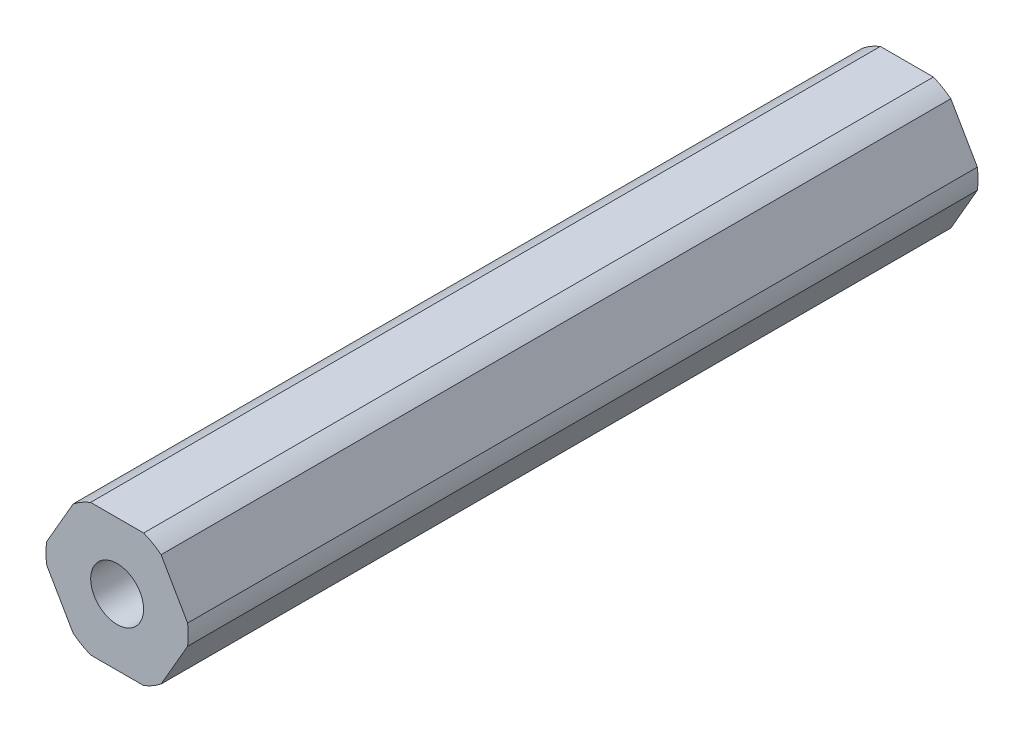
ISO-10303-21;
HEADER;
FILE_DESCRIPTION(('STEP AP214'),'2;1');
FILE_NAME('part.step','',(''),(''),'','','');
FILE_SCHEMA(('AUTOMOTIVE_DESIGN { 1 0 10303 214 1 1 1 1 }'));
ENDSEC;
DATA;
#1=APPLICATION_CONTEXT('core data for automotive mechanical design processes');
#2=APPLICATION_PROTOCOL_DEFINITION('international standard','automotive_design',2000,#1);
#3=PRODUCT_CONTEXT('',#1,'mechanical');
#4=PRODUCT('Part','Part','',(#3));
#5=PRODUCT_RELATED_PRODUCT_CATEGORY('part','',(#4));
#6=PRODUCT_DEFINITION_FORMATION('','',#4);
#7=PRODUCT_DEFINITION_CONTEXT('part definition',#1,'design');
#8=PRODUCT_DEFINITION('design','',#6,#7);
#9=PRODUCT_DEFINITION_SHAPE('','',#8);
#10=(LENGTH_UNIT() NAMED_UNIT(*) SI_UNIT(.MILLI.,.METRE.));
#11=(NAMED_UNIT(*) PLANE_ANGLE_UNIT() SI_UNIT($,.RADIAN.));
#12=(NAMED_UNIT(*) SI_UNIT($,.STERADIAN.) SOLID_ANGLE_UNIT());
#13=UNCERTAINTY_MEASURE_WITH_UNIT(LENGTH_MEASURE(1.E-05),#10,'distance_accuracy_value','');
#14=(GEOMETRIC_REPRESENTATION_CONTEXT(3) GLOBAL_UNCERTAINTY_ASSIGNED_CONTEXT((#13)) GLOBAL_UNIT_ASSIGNED_CONTEXT((#10,
#11,#12)) REPRESENTATION_CONTEXT('',''));
#15=CARTESIAN_POINT('',(0.,0.,0.));
#16=DIRECTION('',(0.,0.,1.));
#17=DIRECTION('',(1.,0.,0.));
#18=AXIS2_PLACEMENT_3D('',#15,#16,#17);
#19=CARTESIAN_POINT('',(0.,0.,-228.6));
#20=DIRECTION('',(0.,0.,-1.));
#21=DIRECTION('',(1.,0.,0.));
#22=AXIS2_PLACEMENT_3D('',#19,#20,#21);
#23=CYLINDRICAL_SURFACE('',#22,2.55);
#24=CARTESIAN_POINT('',(0.,0.,-228.6));
#25=DIRECTION('',(0.,0.,1.));
#26=DIRECTION('',(1.,0.,0.));
#27=AXIS2_PLACEMENT_3D('',#24,#25,#26);
#28=CIRCLE('',#27,2.55);
#29=CARTESIAN_POINT('',(-2.55,0.,-228.6));
#30=VERTEX_POINT('',#29);
#31=EDGE_CURVE('E64',#30,#30,#28,.T.);
#32=ORIENTED_EDGE('',*,*,#31,.F.);
#33=EDGE_LOOP('',(#32));
#34=FACE_BOUND('',#33,.T.);
#35=CARTESIAN_POINT('',(0.,0.,-152.4));
#36=DIRECTION('',(0.,0.,1.));
#37=DIRECTION('',(1.,0.,0.));
#38=AXIS2_PLACEMENT_3D('',#35,#36,#37);
#39=CIRCLE('',#38,2.55);
#40=CARTESIAN_POINT('',(2.55,0.,-152.4));
#41=VERTEX_POINT('',#40);
#42=EDGE_CURVE('E177',#41,#41,#39,.F.);
#43=ORIENTED_EDGE('',*,*,#42,.F.);
#44=EDGE_LOOP('',(#43));
#45=FACE_BOUND('',#44,.T.);
#46=ADVANCED_FACE('F39',(#34,#45),#23,.F.);
#47=CARTESIAN_POINT('',(0.,0.,-228.6));
#48=DIRECTION('',(0.,0.,-1.));
#49=DIRECTION('',(1.,0.,0.));
#50=AXIS2_PLACEMENT_3D('',#47,#48,#49);
#51=CYLINDRICAL_SURFACE('',#50,6.87);
#52=DIRECTION('',(0.,0.,1.));
#53=VECTOR('',#52,1.);
#54=CARTESIAN_POINT('',(6.80102150534208,0.971085209378949,-228.6));
#55=LINE('',#54,#53);
#56=CARTESIAN_POINT('',(6.80102150534208,0.97108520937895,-228.6));
#57=VERTEX_POINT('',#56);
#58=CARTESIAN_POINT('',(6.80102150534208,0.971085209378949,-152.4));
#59=VERTEX_POINT('',#58);
#60=EDGE_CURVE('E163',#57,#59,#55,.T.);
#61=ORIENTED_EDGE('',*,*,#60,.T.);
#62=CARTESIAN_POINT('',(0.,0.,-152.4));
#63=DIRECTION('',(0.,0.,1.));
#64=DIRECTION('',(1.,0.,0.));
#65=AXIS2_PLACEMENT_3D('',#62,#63,#64);
#66=CIRCLE('',#65,6.87);
#67=CARTESIAN_POINT('',(6.80102150534208,-0.971085209378956,-152.4));
#68=VERTEX_POINT('',#67);
#69=EDGE_CURVE('E257',#68,#59,#66,.T.);
#70=ORIENTED_EDGE('',*,*,#69,.F.);
#71=DIRECTION('',(0.,0.,-1.));
#72=VECTOR('',#71,1.);
#73=CARTESIAN_POINT('',(6.80102150534208,-0.971085209378962,-128.6));
#74=LINE('',#73,#72);
#75=CARTESIAN_POINT('',(6.80102150534208,-0.971085209378955,-228.6));
#76=VERTEX_POINT('',#75);
#77=EDGE_CURVE('E11',#68,#76,#74,.T.);
#78=ORIENTED_EDGE('',*,*,#77,.T.);
#79=CARTESIAN_POINT('',(0.,0.,-228.6));
#80=DIRECTION('',(0.,0.,1.));
#81=DIRECTION('',(1.,0.,0.));
#82=AXIS2_PLACEMENT_3D('',#79,#80,#81);
#83=CIRCLE('',#82,6.87);
#84=EDGE_CURVE('E49',#76,#57,#83,.T.);
#85=ORIENTED_EDGE('',*,*,#84,.T.);
#86=EDGE_LOOP('',(#61,#70,#78,#85));
#87=FACE_BOUND('',#86,.T.);
#88=ADVANCED_FACE('F269',(#87),#51,.T.);
#89=CARTESIAN_POINT('',(3.68083890619154,-6.3754,228.6));
#90=DIRECTION('',(-0.866025403784439,0.5,0.));
#91=DIRECTION('',(0.,0.,1.));
#92=AXIS2_PLACEMENT_3D('',#89,#90,#91);
#93=PLANE('',#92);
#94=DIRECTION('',(0.500000000000001,0.866025403784438,0.));
#95=VECTOR('',#94,1.);
#96=CARTESIAN_POINT('',(4.24149521323254,-5.40431479062105,-152.4));
#97=LINE('',#96,#95);
#98=CARTESIAN_POINT('',(4.24149521323254,-5.40431479062105,-152.4));
#99=VERTEX_POINT('',#98);
#100=EDGE_CURVE('E218',#99,#68,#97,.T.);
#101=ORIENTED_EDGE('',*,*,#100,.F.);
#102=DIRECTION('',(0.,0.,1.));
#103=VECTOR('',#102,1.);
#104=CARTESIAN_POINT('',(4.24149521323255,-5.40431479062104,-228.6));
#105=LINE('',#104,#103);
#106=CARTESIAN_POINT('',(4.24149521323254,-5.40431479062105,-228.6));
#107=VERTEX_POINT('',#106);
#108=EDGE_CURVE('E43',#107,#99,#105,.T.);
#109=ORIENTED_EDGE('',*,*,#108,.F.);
#110=DIRECTION('',(0.5,0.866025403784439,0.));
#111=VECTOR('',#110,1.);
#112=CARTESIAN_POINT('',(4.24149521323254,-5.40431479062105,-228.6));
#113=LINE('',#112,#111);
#114=EDGE_CURVE('E175',#107,#76,#113,.T.);
#115=ORIENTED_EDGE('',*,*,#114,.T.);
#116=ORIENTED_EDGE('',*,*,#77,.F.);
#117=EDGE_LOOP('',(#101,#109,#115,#116));
#118=FACE_BOUND('',#117,.T.);
#119=ADVANCED_FACE('F297',(#118),#93,.F.);
#120=CARTESIAN_POINT('',(7.36167781238308,0.,228.6));
#121=DIRECTION('',(-0.866025403784439,-0.5,0.));
#122=DIRECTION('',(0.,0.,1.));
#123=AXIS2_PLACEMENT_3D('',#120,#121,#122);
#124=PLANE('',#123);
#125=DIRECTION('',(-0.5,0.866025403784438,0.));
#126=VECTOR('',#125,1.);
#127=CARTESIAN_POINT('',(6.80102150534208,0.971085209378949,-152.4));
#128=LINE('',#127,#126);
#129=CARTESIAN_POINT('',(4.24149521323254,5.40431479062105,-152.4));
#130=VERTEX_POINT('',#129);
#131=EDGE_CURVE('E57',#59,#130,#128,.T.);
#132=ORIENTED_EDGE('',*,*,#131,.F.);
#133=ORIENTED_EDGE('',*,*,#60,.F.);
#134=DIRECTION('',(-0.5,0.866025403784439,0.));
#135=VECTOR('',#134,1.);
#136=CARTESIAN_POINT('',(6.80102150534208,0.971085209378949,-228.6));
#137=LINE('',#136,#135);
#138=CARTESIAN_POINT('',(4.24149521323254,5.40431479062105,-228.6));
#139=VERTEX_POINT('',#138);
#140=EDGE_CURVE('E185',#57,#139,#137,.T.);
#141=ORIENTED_EDGE('',*,*,#140,.T.);
#142=DIRECTION('',(0.,0.,-1.));
#143=VECTOR('',#142,1.);
#144=CARTESIAN_POINT('',(4.24149521323254,5.40431479062105,-128.6));
#145=LINE('',#144,#143);
#146=EDGE_CURVE('E85',#130,#139,#145,.T.);
#147=ORIENTED_EDGE('',*,*,#146,.F.);
#148=EDGE_LOOP('',(#132,#133,#141,#147));
#149=FACE_BOUND('',#148,.T.);
#150=ADVANCED_FACE('F268',(#149),#124,.F.);
#151=CARTESIAN_POINT('',(3.68083890619154,6.3754,228.6));
#152=DIRECTION('',(0.,-1.,0.));
#153=DIRECTION('',(0.,0.,-1.));
#154=AXIS2_PLACEMENT_3D('',#151,#152,#153);
#155=PLANE('',#154);
#156=DIRECTION('',(-1.,0.,0.));
#157=VECTOR('',#156,1.);
#158=CARTESIAN_POINT('',(2.55952629210953,6.3754,-152.4));
#159=LINE('',#158,#157);
#160=CARTESIAN_POINT('',(2.55952629210953,6.3754,-152.4));
#161=VERTEX_POINT('',#160);
#162=CARTESIAN_POINT('',(-2.55952629210953,6.3754,-152.4));
#163=VERTEX_POINT('',#162);
#164=EDGE_CURVE('E248',#161,#163,#159,.T.);
#165=ORIENTED_EDGE('',*,*,#164,.F.);
#166=DIRECTION('',(0.,0.,1.));
#167=VECTOR('',#166,1.);
#168=CARTESIAN_POINT('',(2.55952629210952,6.3754,-228.6));
#169=LINE('',#168,#167);
#170=CARTESIAN_POINT('',(2.55952629210952,6.3754,-228.6));
#171=VERTEX_POINT('',#170);
#172=EDGE_CURVE('E164',#171,#161,#169,.T.);
#173=ORIENTED_EDGE('',*,*,#172,.F.);
#174=DIRECTION('',(-1.,0.,0.));
#175=VECTOR('',#174,1.);
#176=CARTESIAN_POINT('',(2.55952629210952,6.3754,-228.6));
#177=LINE('',#176,#175);
#178=CARTESIAN_POINT('',(-2.55952629210953,6.3754,-228.6));
#179=VERTEX_POINT('',#178);
#180=EDGE_CURVE('E141',#171,#179,#177,.T.);
#181=ORIENTED_EDGE('',*,*,#180,.T.);
#182=DIRECTION('',(0.,0.,-1.));
#183=VECTOR('',#182,1.);
#184=CARTESIAN_POINT('',(-2.55952629210953,6.3754,-128.6));
#185=LINE('',#184,#183);
#186=EDGE_CURVE('E111',#163,#179,#185,.T.);
#187=ORIENTED_EDGE('',*,*,#186,.F.);
#188=EDGE_LOOP('',(#165,#173,#181,#187));
#189=FACE_BOUND('',#188,.T.);
#190=ADVANCED_FACE('F278',(#189),#155,.F.);
#191=CARTESIAN_POINT('',(-3.68083890619154,6.3754,228.6));
#192=DIRECTION('',(0.866025403784439,-0.5,0.));
#193=DIRECTION('',(0.,0.,-1.));
#194=AXIS2_PLACEMENT_3D('',#191,#192,#193);
#195=PLANE('',#194);
#196=DIRECTION('',(-0.500000000000001,-0.866025403784438,0.));
#197=VECTOR('',#196,1.);
#198=CARTESIAN_POINT('',(-4.24149521323254,5.40431479062105,-152.4));
#199=LINE('',#198,#197);
#200=CARTESIAN_POINT('',(-4.24149521323254,5.40431479062105,-152.4));
#201=VERTEX_POINT('',#200);
#202=CARTESIAN_POINT('',(-6.80102150534208,0.971085209378959,-152.4));
#203=VERTEX_POINT('',#202);
#204=EDGE_CURVE('E240',#201,#203,#199,.T.);
#205=ORIENTED_EDGE('',*,*,#204,.F.);
#206=DIRECTION('',(0.,0.,1.));
#207=VECTOR('',#206,1.);
#208=CARTESIAN_POINT('',(-4.24149521323255,5.40431479062105,-228.6));
#209=LINE('',#208,#207);
#210=CARTESIAN_POINT('',(-4.24149521323255,5.40431479062105,-228.6));
#211=VERTEX_POINT('',#210);
#212=EDGE_CURVE('E118',#211,#201,#209,.T.);
#213=ORIENTED_EDGE('',*,*,#212,.F.);
#214=DIRECTION('',(-0.5,-0.866025403784439,0.));
#215=VECTOR('',#214,1.);
#216=CARTESIAN_POINT('',(-4.24149521323254,5.40431479062105,-228.6));
#217=LINE('',#216,#215);
#218=CARTESIAN_POINT('',(-6.80102150534208,0.97108520937896,-228.6));
#219=VERTEX_POINT('',#218);
#220=EDGE_CURVE('E136',#211,#219,#217,.T.);
#221=ORIENTED_EDGE('',*,*,#220,.T.);
#222=DIRECTION('',(0.,0.,-1.));
#223=VECTOR('',#222,1.);
#224=CARTESIAN_POINT('',(-6.80102150534208,0.97108520937896,-128.6));
#225=LINE('',#224,#223);
#226=EDGE_CURVE('E125',#203,#219,#225,.T.);
#227=ORIENTED_EDGE('',*,*,#226,.F.);
#228=EDGE_LOOP('',(#205,#213,#221,#227));
#229=FACE_BOUND('',#228,.T.);
#230=ADVANCED_FACE('F137',(#229),#195,.F.);
#231=CARTESIAN_POINT('',(-7.36167781238308,0.,228.6));
#232=DIRECTION('',(0.866025403784439,0.5,0.));
#233=DIRECTION('',(0.,0.,-1.));
#234=AXIS2_PLACEMENT_3D('',#231,#232,#233);
#235=PLANE('',#234);
#236=DIRECTION('',(0.5,-0.866025403784439,0.));
#237=VECTOR('',#236,1.);
#238=CARTESIAN_POINT('',(-6.80102150534208,-0.971085209378948,-152.4));
#239=LINE('',#238,#237);
#240=CARTESIAN_POINT('',(-6.80102150534208,-0.971085209378948,-152.4));
#241=VERTEX_POINT('',#240);
#242=CARTESIAN_POINT('',(-4.24149521323255,-5.40431479062105,-152.4));
#243=VERTEX_POINT('',#242);
#244=EDGE_CURVE('E234',#241,#243,#239,.T.);
#245=ORIENTED_EDGE('',*,*,#244,.F.);
#246=DIRECTION('',(0.,0.,1.));
#247=VECTOR('',#246,1.);
#248=CARTESIAN_POINT('',(-6.80102150534208,-0.971085209378962,-228.6));
#249=LINE('',#248,#247);
#250=CARTESIAN_POINT('',(-6.80102150534208,-0.971085209378956,-228.6));
#251=VERTEX_POINT('',#250);
#252=EDGE_CURVE('E134',#251,#241,#249,.T.);
#253=ORIENTED_EDGE('',*,*,#252,.F.);
#254=DIRECTION('',(0.5,-0.866025403784439,0.));
#255=VECTOR('',#254,1.);
#256=CARTESIAN_POINT('',(-6.80102150534208,-0.971085209378954,-228.6));
#257=LINE('',#256,#255);
#258=CARTESIAN_POINT('',(-4.24149521323254,-5.40431479062105,-228.6));
#259=VERTEX_POINT('',#258);
#260=EDGE_CURVE('E142',#251,#259,#257,.T.);
#261=ORIENTED_EDGE('',*,*,#260,.T.);
#262=DIRECTION('',(0.,0.,-1.));
#263=VECTOR('',#262,1.);
#264=CARTESIAN_POINT('',(-4.24149521323255,-5.40431479062104,-128.6));
#265=LINE('',#264,#263);
#266=EDGE_CURVE('E188',#243,#259,#265,.T.);
#267=ORIENTED_EDGE('',*,*,#266,.F.);
#268=EDGE_LOOP('',(#245,#253,#261,#267));
#269=FACE_BOUND('',#268,.T.);
#270=ADVANCED_FACE('F310',(#269),#235,.F.);
#271=CARTESIAN_POINT('',(-3.68083890619154,-6.3754,228.6));
#272=DIRECTION('',(0.,1.,0.));
#273=DIRECTION('',(0.,0.,1.));
#274=AXIS2_PLACEMENT_3D('',#271,#272,#273);
#275=PLANE('',#274);
#276=DIRECTION('',(1.,0.,0.));
#277=VECTOR('',#276,1.);
#278=CARTESIAN_POINT('',(-2.55952629210953,-6.3754,-152.4));
#279=LINE('',#278,#277);
#280=CARTESIAN_POINT('',(-2.55952629210953,-6.3754,-152.4));
#281=VERTEX_POINT('',#280);
#282=CARTESIAN_POINT('',(2.55952629210953,-6.3754,-152.4));
#283=VERTEX_POINT('',#282);
#284=EDGE_CURVE('E226',#281,#283,#279,.T.);
#285=ORIENTED_EDGE('',*,*,#284,.F.);
#286=DIRECTION('',(0.,0.,1.));
#287=VECTOR('',#286,1.);
#288=CARTESIAN_POINT('',(-2.55952629210953,-6.3754,-228.6));
#289=LINE('',#288,#287);
#290=CARTESIAN_POINT('',(-2.55952629210953,-6.3754,-228.6));
#291=VERTEX_POINT('',#290);
#292=EDGE_CURVE('E190',#291,#281,#289,.T.);
#293=ORIENTED_EDGE('',*,*,#292,.F.);
#294=DIRECTION('',(1.,0.,0.));
#295=VECTOR('',#294,1.);
#296=CARTESIAN_POINT('',(-2.55952629210953,-6.3754,-228.6));
#297=LINE('',#296,#295);
#298=CARTESIAN_POINT('',(2.55952629210953,-6.3754,-228.6));
#299=VERTEX_POINT('',#298);
#300=EDGE_CURVE('E156',#291,#299,#297,.T.);
#301=ORIENTED_EDGE('',*,*,#300,.T.);
#302=DIRECTION('',(0.,0.,-1.));
#303=VECTOR('',#302,1.);
#304=CARTESIAN_POINT('',(2.55952629210953,-6.3754,-128.6));
#305=LINE('',#304,#303);
#306=EDGE_CURVE('E179',#283,#299,#305,.T.);
#307=ORIENTED_EDGE('',*,*,#306,.F.);
#308=EDGE_LOOP('',(#285,#293,#301,#307));
#309=FACE_BOUND('',#308,.T.);
#310=ADVANCED_FACE('F303',(#309),#275,.F.);
#311=CARTESIAN_POINT('',(0.,0.,-228.6));
#312=DIRECTION('',(0.,0.,-1.));
#313=DIRECTION('',(1.,0.,0.));
#314=AXIS2_PLACEMENT_3D('',#311,#312,#313);
#315=CYLINDRICAL_SURFACE('',#314,6.87);
#316=ORIENTED_EDGE('',*,*,#108,.T.);
#317=CARTESIAN_POINT('',(0.,0.,-152.4));
#318=DIRECTION('',(0.,0.,1.));
#319=DIRECTION('',(1.,0.,0.));
#320=AXIS2_PLACEMENT_3D('',#317,#318,#319);
#321=CIRCLE('',#320,6.87);
#322=EDGE_CURVE('E222',#283,#99,#321,.T.);
#323=ORIENTED_EDGE('',*,*,#322,.F.);
#324=ORIENTED_EDGE('',*,*,#306,.T.);
#325=CARTESIAN_POINT('',(0.,0.,-228.6));
#326=DIRECTION('',(0.,0.,1.));
#327=DIRECTION('',(1.,0.,0.));
#328=AXIS2_PLACEMENT_3D('',#325,#326,#327);
#329=CIRCLE('',#328,6.87);
#330=EDGE_CURVE('E181',#299,#107,#329,.T.);
#331=ORIENTED_EDGE('',*,*,#330,.T.);
#332=EDGE_LOOP('',(#316,#323,#324,#331));
#333=FACE_BOUND('',#332,.T.);
#334=ADVANCED_FACE('F298',(#333),#315,.T.);
#335=CARTESIAN_POINT('',(0.,0.,-228.6));
#336=DIRECTION('',(0.,0.,-1.));
#337=DIRECTION('',(1.,0.,0.));
#338=AXIS2_PLACEMENT_3D('',#335,#336,#337);
#339=CYLINDRICAL_SURFACE('',#338,6.87);
#340=ORIENTED_EDGE('',*,*,#292,.T.);
#341=CARTESIAN_POINT('',(0.,0.,-152.4));
#342=DIRECTION('',(0.,0.,1.));
#343=DIRECTION('',(1.,0.,0.));
#344=AXIS2_PLACEMENT_3D('',#341,#342,#343);
#345=CIRCLE('',#344,6.87);
#346=EDGE_CURVE('E230',#243,#281,#345,.T.);
#347=ORIENTED_EDGE('',*,*,#346,.F.);
#348=ORIENTED_EDGE('',*,*,#266,.T.);
#349=CARTESIAN_POINT('',(0.,0.,-228.6));
#350=DIRECTION('',(0.,0.,1.));
#351=DIRECTION('',(1.,0.,0.));
#352=AXIS2_PLACEMENT_3D('',#349,#350,#351);
#353=CIRCLE('',#352,6.87);
#354=EDGE_CURVE('E191',#259,#291,#353,.T.);
#355=ORIENTED_EDGE('',*,*,#354,.T.);
#356=EDGE_LOOP('',(#340,#347,#348,#355));
#357=FACE_BOUND('',#356,.T.);
#358=ADVANCED_FACE('F302',(#357),#339,.T.);
#359=CARTESIAN_POINT('',(0.,0.,-228.6));
#360=DIRECTION('',(0.,0.,-1.));
#361=DIRECTION('',(1.,0.,0.));
#362=AXIS2_PLACEMENT_3D('',#359,#360,#361);
#363=CYLINDRICAL_SURFACE('',#362,6.87);
#364=ORIENTED_EDGE('',*,*,#252,.T.);
#365=CARTESIAN_POINT('',(0.,0.,-152.4));
#366=DIRECTION('',(0.,0.,1.));
#367=DIRECTION('',(1.,0.,0.));
#368=AXIS2_PLACEMENT_3D('',#365,#366,#367);
#369=CIRCLE('',#368,6.87);
#370=EDGE_CURVE('E132',#203,#241,#369,.T.);
#371=ORIENTED_EDGE('',*,*,#370,.F.);
#372=ORIENTED_EDGE('',*,*,#226,.T.);
#373=CARTESIAN_POINT('',(0.,0.,-228.6));
#374=DIRECTION('',(0.,0.,1.));
#375=DIRECTION('',(1.,0.,0.));
#376=AXIS2_PLACEMENT_3D('',#373,#374,#375);
#377=CIRCLE('',#376,6.87);
#378=EDGE_CURVE('E129',#219,#251,#377,.T.);
#379=ORIENTED_EDGE('',*,*,#378,.T.);
#380=EDGE_LOOP('',(#364,#371,#372,#379));
#381=FACE_BOUND('',#380,.T.);
#382=ADVANCED_FACE('F127',(#381),#363,.T.);
#383=CARTESIAN_POINT('',(0.,0.,-228.6));
#384=DIRECTION('',(0.,0.,-1.));
#385=DIRECTION('',(1.,0.,0.));
#386=AXIS2_PLACEMENT_3D('',#383,#384,#385);
#387=CYLINDRICAL_SURFACE('',#386,6.87);
#388=ORIENTED_EDGE('',*,*,#212,.T.);
#389=CARTESIAN_POINT('',(0.,0.,-152.4));
#390=DIRECTION('',(0.,0.,1.));
#391=DIRECTION('',(1.,0.,0.));
#392=AXIS2_PLACEMENT_3D('',#389,#390,#391);
#393=CIRCLE('',#392,6.87);
#394=EDGE_CURVE('E244',#163,#201,#393,.T.);
#395=ORIENTED_EDGE('',*,*,#394,.F.);
#396=ORIENTED_EDGE('',*,*,#186,.T.);
#397=CARTESIAN_POINT('',(0.,0.,-228.6));
#398=DIRECTION('',(0.,0.,1.));
#399=DIRECTION('',(1.,0.,0.));
#400=AXIS2_PLACEMENT_3D('',#397,#398,#399);
#401=CIRCLE('',#400,6.87);
#402=EDGE_CURVE('E168',#179,#211,#401,.T.);
#403=ORIENTED_EDGE('',*,*,#402,.T.);
#404=EDGE_LOOP('',(#388,#395,#396,#403));
#405=FACE_BOUND('',#404,.T.);
#406=ADVANCED_FACE('F281',(#405),#387,.T.);
#407=CARTESIAN_POINT('',(0.,0.,-228.6));
#408=DIRECTION('',(0.,0.,-1.));
#409=DIRECTION('',(1.,0.,0.));
#410=AXIS2_PLACEMENT_3D('',#407,#408,#409);
#411=CYLINDRICAL_SURFACE('',#410,6.87);
#412=ORIENTED_EDGE('',*,*,#172,.T.);
#413=CARTESIAN_POINT('',(0.,0.,-152.4));
#414=DIRECTION('',(0.,0.,1.));
#415=DIRECTION('',(1.,0.,0.));
#416=AXIS2_PLACEMENT_3D('',#413,#414,#415);
#417=CIRCLE('',#416,6.87);
#418=EDGE_CURVE('E252',#130,#161,#417,.T.);
#419=ORIENTED_EDGE('',*,*,#418,.F.);
#420=ORIENTED_EDGE('',*,*,#146,.T.);
#421=CARTESIAN_POINT('',(0.,0.,-228.6));
#422=DIRECTION('',(0.,0.,1.));
#423=DIRECTION('',(1.,0.,0.));
#424=AXIS2_PLACEMENT_3D('',#421,#422,#423);
#425=CIRCLE('',#424,6.87);
#426=EDGE_CURVE('E171',#139,#171,#425,.T.);
#427=ORIENTED_EDGE('',*,*,#426,.T.);
#428=EDGE_LOOP('',(#412,#419,#420,#427));
#429=FACE_BOUND('',#428,.T.);
#430=ADVANCED_FACE('F273',(#429),#411,.T.);
#431=CARTESIAN_POINT('',(0.,0.,-228.6));
#432=DIRECTION('',(0.,0.,1.));
#433=DIRECTION('',(1.,0.,0.));
#434=AXIS2_PLACEMENT_3D('',#431,#432,#433);
#435=PLANE('',#434);
#436=ORIENTED_EDGE('',*,*,#426,.F.);
#437=ORIENTED_EDGE('',*,*,#140,.F.);
#438=ORIENTED_EDGE('',*,*,#84,.F.);
#439=ORIENTED_EDGE('',*,*,#114,.F.);
#440=ORIENTED_EDGE('',*,*,#330,.F.);
#441=ORIENTED_EDGE('',*,*,#300,.F.);
#442=ORIENTED_EDGE('',*,*,#354,.F.);
#443=ORIENTED_EDGE('',*,*,#260,.F.);
#444=ORIENTED_EDGE('',*,*,#378,.F.);
#445=ORIENTED_EDGE('',*,*,#220,.F.);
#446=ORIENTED_EDGE('',*,*,#402,.F.);
#447=ORIENTED_EDGE('',*,*,#180,.F.);
#448=EDGE_LOOP('',(#436,#437,#438,#439,#440,#441,#442,#443,#444,#445,#446,#447));
#449=FACE_BOUND('',#448,.T.);
#450=ORIENTED_EDGE('',*,*,#31,.T.);
#451=EDGE_LOOP('',(#450));
#452=FACE_BOUND('',#451,.T.);
#453=ADVANCED_FACE('F41',(#449,#452),#435,.F.);
#454=CARTESIAN_POINT('',(0.,0.,-152.4));
#455=DIRECTION('',(0.,0.,1.));
#456=DIRECTION('',(1.,0.,0.));
#457=AXIS2_PLACEMENT_3D('',#454,#455,#456);
#458=PLANE('',#457);
#459=ORIENTED_EDGE('',*,*,#69,.T.);
#460=ORIENTED_EDGE('',*,*,#131,.T.);
#461=ORIENTED_EDGE('',*,*,#418,.T.);
#462=ORIENTED_EDGE('',*,*,#164,.T.);
#463=ORIENTED_EDGE('',*,*,#394,.T.);
#464=ORIENTED_EDGE('',*,*,#204,.T.);
#465=ORIENTED_EDGE('',*,*,#370,.T.);
#466=ORIENTED_EDGE('',*,*,#244,.T.);
#467=ORIENTED_EDGE('',*,*,#346,.T.);
#468=ORIENTED_EDGE('',*,*,#284,.T.);
#469=ORIENTED_EDGE('',*,*,#322,.T.);
#470=ORIENTED_EDGE('',*,*,#100,.T.);
#471=EDGE_LOOP('',(#459,#460,#461,#462,#463,#464,#465,#466,#467,#468,#469,#470));
#472=FACE_BOUND('',#471,.T.);
#473=ORIENTED_EDGE('',*,*,#42,.T.);
#474=EDGE_LOOP('',(#473));
#475=FACE_BOUND('',#474,.T.);
#476=ADVANCED_FACE('F261',(#472,#475),#458,.T.);
#477=CLOSED_SHELL('',(#46,#88,#119,#150,#190,#230,#270,#310,#334,#358,#382,#406,#430,#453,#476));
#478=MANIFOLD_SOLID_BREP('B2',#477);
#479=ADVANCED_BREP_SHAPE_REPRESENTATION('',(#18,#478),#14);
#480=SHAPE_DEFINITION_REPRESENTATION(#9,#479);
ENDSEC;
END-ISO-10303-21;
